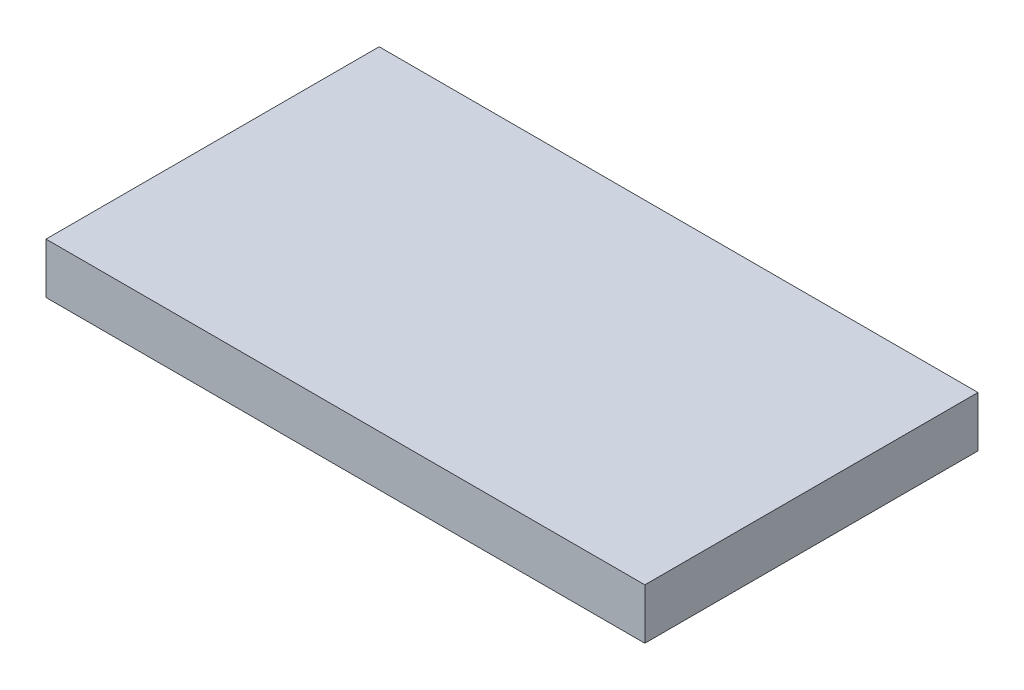
ISO-10303-21;
HEADER;
FILE_DESCRIPTION(('STEP AP214'),'2;1');
FILE_NAME('part.step','',(''),(''),'','','');
FILE_SCHEMA(('AUTOMOTIVE_DESIGN { 1 0 10303 214 1 1 1 1 }'));
ENDSEC;
DATA;
#1=APPLICATION_CONTEXT('core data for automotive mechanical design processes');
#2=APPLICATION_PROTOCOL_DEFINITION('international standard','automotive_design',2000,#1);
#3=PRODUCT_CONTEXT('',#1,'mechanical');
#4=PRODUCT('Part','Part','',(#3));
#5=PRODUCT_RELATED_PRODUCT_CATEGORY('part','',(#4));
#6=PRODUCT_DEFINITION_FORMATION('','',#4);
#7=PRODUCT_DEFINITION_CONTEXT('part definition',#1,'design');
#8=PRODUCT_DEFINITION('design','',#6,#7);
#9=PRODUCT_DEFINITION_SHAPE('','',#8);
#10=(LENGTH_UNIT() NAMED_UNIT(*) SI_UNIT(.MILLI.,.METRE.));
#11=(NAMED_UNIT(*) PLANE_ANGLE_UNIT() SI_UNIT($,.RADIAN.));
#12=(NAMED_UNIT(*) SI_UNIT($,.STERADIAN.) SOLID_ANGLE_UNIT());
#13=UNCERTAINTY_MEASURE_WITH_UNIT(LENGTH_MEASURE(1.E-05),#10,'distance_accuracy_value','');
#14=(GEOMETRIC_REPRESENTATION_CONTEXT(3) GLOBAL_UNCERTAINTY_ASSIGNED_CONTEXT((#13)) GLOBAL_UNIT_ASSIGNED_CONTEXT((#10,
#11,#12)) REPRESENTATION_CONTEXT('',''));
#15=CARTESIAN_POINT('',(0.,0.,0.));
#16=DIRECTION('',(0.,0.,1.));
#17=DIRECTION('',(1.,0.,0.));
#18=AXIS2_PLACEMENT_3D('',#15,#16,#17);
#19=CARTESIAN_POINT('',(0.,1.524,0.));
#20=DIRECTION('',(1.,0.,0.));
#21=DIRECTION('',(0.,0.,-1.));
#22=AXIS2_PLACEMENT_3D('',#19,#20,#21);
#23=PLANE('',#22);
#24=DIRECTION('',(0.,0.,1.));
#25=VECTOR('',#24,1.);
#26=CARTESIAN_POINT('',(0.,0.,0.));
#27=LINE('',#26,#25);
#28=CARTESIAN_POINT('',(0.,0.,-10.033));
#29=VERTEX_POINT('',#28);
#30=CARTESIAN_POINT('',(0.,0.,0.));
#31=VERTEX_POINT('',#30);
#32=EDGE_CURVE('E102',#29,#31,#27,.T.);
#33=ORIENTED_EDGE('',*,*,#32,.T.);
#34=DIRECTION('',(0.,-1.,0.));
#35=VECTOR('',#34,1.);
#36=CARTESIAN_POINT('',(0.,1.524,0.));
#37=LINE('',#36,#35);
#38=CARTESIAN_POINT('',(0.,1.524,0.));
#39=VERTEX_POINT('',#38);
#40=EDGE_CURVE('E11',#39,#31,#37,.T.);
#41=ORIENTED_EDGE('',*,*,#40,.F.);
#42=DIRECTION('',(0.,0.,1.));
#43=VECTOR('',#42,1.);
#44=CARTESIAN_POINT('',(0.,1.524,0.));
#45=LINE('',#44,#43);
#46=CARTESIAN_POINT('',(0.,1.524,-10.033));
#47=VERTEX_POINT('',#46);
#48=EDGE_CURVE('E90',#47,#39,#45,.T.);
#49=ORIENTED_EDGE('',*,*,#48,.F.);
#50=DIRECTION('',(0.,-1.,0.));
#51=VECTOR('',#50,1.);
#52=CARTESIAN_POINT('',(0.,1.524,-10.033));
#53=LINE('',#52,#51);
#54=EDGE_CURVE('E98',#47,#29,#53,.T.);
#55=ORIENTED_EDGE('',*,*,#54,.T.);
#56=EDGE_LOOP('',(#33,#41,#49,#55));
#57=FACE_BOUND('',#56,.T.);
#58=ADVANCED_FACE('F39',(#57),#23,.F.);
#59=CARTESIAN_POINT('',(0.,1.524,0.));
#60=DIRECTION('',(0.,0.,-1.));
#61=DIRECTION('',(-1.,0.,0.));
#62=AXIS2_PLACEMENT_3D('',#59,#60,#61);
#63=PLANE('',#62);
#64=DIRECTION('',(1.,0.,0.));
#65=VECTOR('',#64,1.);
#66=CARTESIAN_POINT('',(0.,0.,0.));
#67=LINE('',#66,#65);
#68=CARTESIAN_POINT('',(18.034,0.,0.));
#69=VERTEX_POINT('',#68);
#70=EDGE_CURVE('E94',#31,#69,#67,.T.);
#71=ORIENTED_EDGE('',*,*,#70,.T.);
#72=DIRECTION('',(0.,-1.,0.));
#73=VECTOR('',#72,1.);
#74=CARTESIAN_POINT('',(18.034,1.524,0.));
#75=LINE('',#74,#73);
#76=CARTESIAN_POINT('',(18.034,1.524,0.));
#77=VERTEX_POINT('',#76);
#78=EDGE_CURVE('E47',#77,#69,#75,.T.);
#79=ORIENTED_EDGE('',*,*,#78,.F.);
#80=DIRECTION('',(1.,0.,0.));
#81=VECTOR('',#80,1.);
#82=CARTESIAN_POINT('',(0.,1.524,0.));
#83=LINE('',#82,#81);
#84=EDGE_CURVE('E85',#39,#77,#83,.T.);
#85=ORIENTED_EDGE('',*,*,#84,.F.);
#86=ORIENTED_EDGE('',*,*,#40,.T.);
#87=EDGE_LOOP('',(#71,#79,#85,#86));
#88=FACE_BOUND('',#87,.T.);
#89=ADVANCED_FACE('F93',(#88),#63,.F.);
#90=CARTESIAN_POINT('',(18.034,1.524,0.));
#91=DIRECTION('',(-1.,0.,0.));
#92=DIRECTION('',(0.,0.,1.));
#93=AXIS2_PLACEMENT_3D('',#90,#91,#92);
#94=PLANE('',#93);
#95=DIRECTION('',(0.,0.,-1.));
#96=VECTOR('',#95,1.);
#97=CARTESIAN_POINT('',(18.034,0.,0.));
#98=LINE('',#97,#96);
#99=CARTESIAN_POINT('',(18.034,0.,-10.033));
#100=VERTEX_POINT('',#99);
#101=EDGE_CURVE('E72',#69,#100,#98,.T.);
#102=ORIENTED_EDGE('',*,*,#101,.T.);
#103=DIRECTION('',(0.,-1.,0.));
#104=VECTOR('',#103,1.);
#105=CARTESIAN_POINT('',(18.034,1.524,-10.033));
#106=LINE('',#105,#104);
#107=CARTESIAN_POINT('',(18.034,1.524,-10.033));
#108=VERTEX_POINT('',#107);
#109=EDGE_CURVE('E95',#108,#100,#106,.T.);
#110=ORIENTED_EDGE('',*,*,#109,.F.);
#111=DIRECTION('',(0.,0.,-1.));
#112=VECTOR('',#111,1.);
#113=CARTESIAN_POINT('',(18.034,1.524,0.));
#114=LINE('',#113,#112);
#115=EDGE_CURVE('E88',#77,#108,#114,.T.);
#116=ORIENTED_EDGE('',*,*,#115,.F.);
#117=ORIENTED_EDGE('',*,*,#78,.T.);
#118=EDGE_LOOP('',(#102,#110,#116,#117));
#119=FACE_BOUND('',#118,.T.);
#120=ADVANCED_FACE('F96',(#119),#94,.F.);
#121=CARTESIAN_POINT('',(0.,1.524,-10.033));
#122=DIRECTION('',(0.,0.,1.));
#123=DIRECTION('',(1.,0.,0.));
#124=AXIS2_PLACEMENT_3D('',#121,#122,#123);
#125=PLANE('',#124);
#126=DIRECTION('',(-1.,0.,0.));
#127=VECTOR('',#126,1.);
#128=CARTESIAN_POINT('',(0.,0.,-10.033));
#129=LINE('',#128,#127);
#130=EDGE_CURVE('E78',#100,#29,#129,.T.);
#131=ORIENTED_EDGE('',*,*,#130,.T.);
#132=ORIENTED_EDGE('',*,*,#54,.F.);
#133=DIRECTION('',(-1.,0.,0.));
#134=VECTOR('',#133,1.);
#135=CARTESIAN_POINT('',(0.,1.524,-10.033));
#136=LINE('',#135,#134);
#137=EDGE_CURVE('E55',#108,#47,#136,.T.);
#138=ORIENTED_EDGE('',*,*,#137,.F.);
#139=ORIENTED_EDGE('',*,*,#109,.T.);
#140=EDGE_LOOP('',(#131,#132,#138,#139));
#141=FACE_BOUND('',#140,.T.);
#142=ADVANCED_FACE('F109',(#141),#125,.F.);
#143=CARTESIAN_POINT('',(0.,1.524,0.));
#144=DIRECTION('',(0.,-1.,0.));
#145=DIRECTION('',(0.,0.,-1.));
#146=AXIS2_PLACEMENT_3D('',#143,#144,#145);
#147=PLANE('',#146);
#148=ORIENTED_EDGE('',*,*,#48,.T.);
#149=ORIENTED_EDGE('',*,*,#84,.T.);
#150=ORIENTED_EDGE('',*,*,#115,.T.);
#151=ORIENTED_EDGE('',*,*,#137,.T.);
#152=EDGE_LOOP('',(#148,#149,#150,#151));
#153=FACE_BOUND('',#152,.T.);
#154=ADVANCED_FACE('F86',(#153),#147,.F.);
#155=CARTESIAN_POINT('',(0.,0.,0.));
#156=DIRECTION('',(0.,-1.,0.));
#157=DIRECTION('',(0.,0.,-1.));
#158=AXIS2_PLACEMENT_3D('',#155,#156,#157);
#159=PLANE('',#158);
#160=ORIENTED_EDGE('',*,*,#32,.F.);
#161=ORIENTED_EDGE('',*,*,#130,.F.);
#162=ORIENTED_EDGE('',*,*,#101,.F.);
#163=ORIENTED_EDGE('',*,*,#70,.F.);
#164=EDGE_LOOP('',(#160,#161,#162,#163));
#165=FACE_BOUND('',#164,.T.);
#166=ADVANCED_FACE('F112',(#165),#159,.T.);
#167=CLOSED_SHELL('',(#58,#89,#120,#142,#154,#166));
#168=MANIFOLD_SOLID_BREP('B2',#167);
#169=ADVANCED_BREP_SHAPE_REPRESENTATION('',(#18,#168),#14);
#170=SHAPE_DEFINITION_REPRESENTATION(#9,#169);
ENDSEC;
END-ISO-10303-21;
